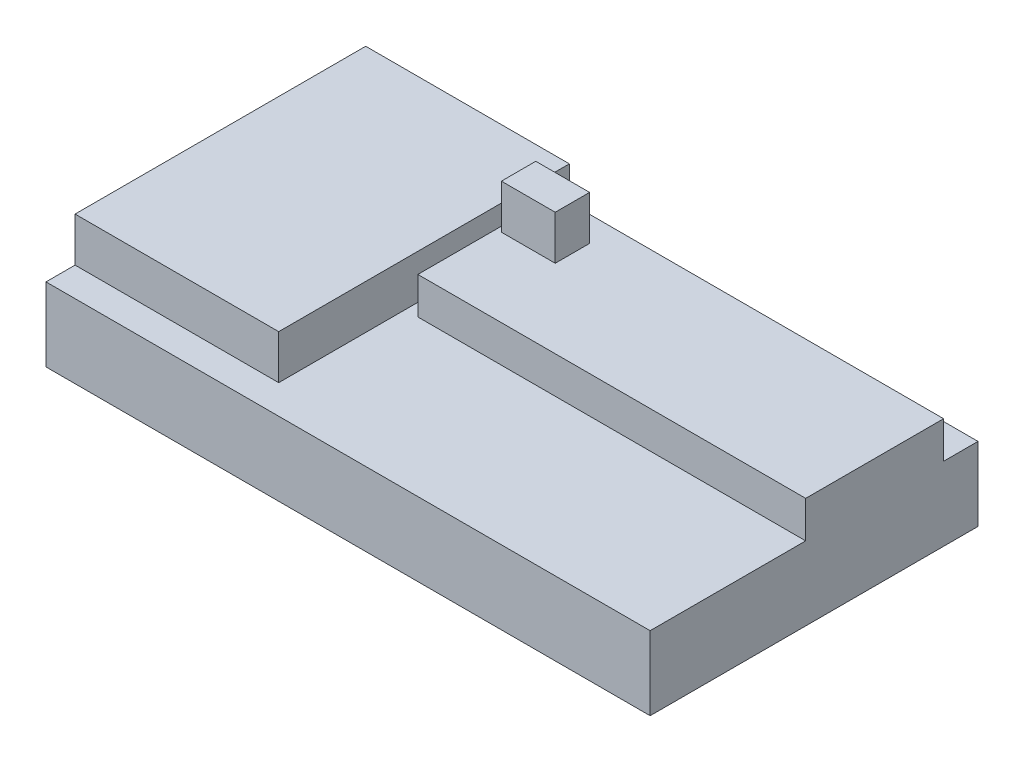
ISO-10303-21;
HEADER;
FILE_DESCRIPTION(('STEP AP214'),'2;1');
FILE_NAME('part.step','',(''),(''),'','','');
FILE_SCHEMA(('AUTOMOTIVE_DESIGN { 1 0 10303 214 1 1 1 1 }'));
ENDSEC;
DATA;
#1=APPLICATION_CONTEXT('core data for automotive mechanical design processes');
#2=APPLICATION_PROTOCOL_DEFINITION('international standard','automotive_design',2000,#1);
#3=PRODUCT_CONTEXT('',#1,'mechanical');
#4=PRODUCT('Part','Part','',(#3));
#5=PRODUCT_RELATED_PRODUCT_CATEGORY('part','',(#4));
#6=PRODUCT_DEFINITION_FORMATION('','',#4);
#7=PRODUCT_DEFINITION_CONTEXT('part definition',#1,'design');
#8=PRODUCT_DEFINITION('design','',#6,#7);
#9=PRODUCT_DEFINITION_SHAPE('','',#8);
#10=(LENGTH_UNIT() NAMED_UNIT(*) SI_UNIT(.MILLI.,.METRE.));
#11=(NAMED_UNIT(*) PLANE_ANGLE_UNIT() SI_UNIT($,.RADIAN.));
#12=(NAMED_UNIT(*) SI_UNIT($,.STERADIAN.) SOLID_ANGLE_UNIT());
#13=UNCERTAINTY_MEASURE_WITH_UNIT(LENGTH_MEASURE(1.E-05),#10,'distance_accuracy_value','');
#14=(GEOMETRIC_REPRESENTATION_CONTEXT(3) GLOBAL_UNCERTAINTY_ASSIGNED_CONTEXT((#13)) GLOBAL_UNIT_ASSIGNED_CONTEXT((#10,
#11,#12)) REPRESENTATION_CONTEXT('',''));
#15=CARTESIAN_POINT('',(0.,0.,0.));
#16=DIRECTION('',(0.,0.,1.));
#17=DIRECTION('',(1.,0.,0.));
#18=AXIS2_PLACEMENT_3D('',#15,#16,#17);
#19=CARTESIAN_POINT('',(0.,15.,0.));
#20=DIRECTION('',(0.,-1.,0.));
#21=DIRECTION('',(0.,0.,-1.));
#22=AXIS2_PLACEMENT_3D('',#19,#20,#21);
#23=PLANE('',#22);
#24=DIRECTION('',(0.,0.,-1.));
#25=VECTOR('',#24,1.);
#26=CARTESIAN_POINT('',(42.955938697318,15.,-17.9245794943016));
#27=LINE('',#26,#25);
#28=CARTESIAN_POINT('',(42.955938697318,15.,0.797509226608041));
#29=VERTEX_POINT('',#28);
#30=CARTESIAN_POINT('',(42.955938697318,15.,-17.9245794943016));
#31=VERTEX_POINT('',#30);
#32=EDGE_CURVE('E199',#29,#31,#27,.T.);
#33=ORIENTED_EDGE('',*,*,#32,.T.);
#34=DIRECTION('',(-1.,0.,0.));
#35=VECTOR('',#34,1.);
#36=CARTESIAN_POINT('',(42.955938697318,15.,-17.9245794943016));
#37=LINE('',#36,#35);
#38=CARTESIAN_POINT('',(-9.68211645351766,15.,-17.9245794943016));
#39=VERTEX_POINT('',#38);
#40=EDGE_CURVE('E202',#31,#39,#37,.T.);
#41=ORIENTED_EDGE('',*,*,#40,.T.);
#42=DIRECTION('',(0.,0.,1.));
#43=VECTOR('',#42,1.);
#44=CARTESIAN_POINT('',(-9.68211645351766,15.,-17.9245794943016));
#45=LINE('',#44,#43);
#46=CARTESIAN_POINT('',(-9.68211645351766,15.,0.797509226608041));
#47=VERTEX_POINT('',#46);
#48=EDGE_CURVE('E205',#39,#47,#45,.T.);
#49=ORIENTED_EDGE('',*,*,#48,.T.);
#50=DIRECTION('',(1.,0.,0.));
#51=VECTOR('',#50,1.);
#52=CARTESIAN_POINT('',(42.955938697318,15.,0.797509226608041));
#53=LINE('',#52,#51);
#54=EDGE_CURVE('E207',#47,#29,#53,.T.);
#55=ORIENTED_EDGE('',*,*,#54,.T.);
#56=EDGE_LOOP('',(#33,#41,#49,#55));
#57=FACE_BOUND('',#56,.T.);
#58=DIRECTION('',(0.,0.,1.));
#59=VECTOR('',#58,1.);
#60=CARTESIAN_POINT('',(-8.98032148722194,15.,-14.5036047666736));
#61=LINE('',#60,#59);
#62=CARTESIAN_POINT('',(-8.98032148722194,15.,-14.5036047666736));
#63=VERTEX_POINT('',#62);
#64=CARTESIAN_POINT('',(-8.98032148722194,15.,-9.83587875546732));
#65=VERTEX_POINT('',#64);
#66=EDGE_CURVE('E166',#63,#65,#61,.T.);
#67=ORIENTED_EDGE('',*,*,#66,.F.);
#68=DIRECTION('',(-1.,0.,0.));
#69=VECTOR('',#68,1.);
#70=CARTESIAN_POINT('',(-8.98032148722194,15.,-14.5036047666736));
#71=LINE('',#70,#69);
#72=CARTESIAN_POINT('',(-1.67256698383511,15.,-14.5036047666736));
#73=VERTEX_POINT('',#72);
#74=EDGE_CURVE('E163',#73,#63,#71,.T.);
#75=ORIENTED_EDGE('',*,*,#74,.F.);
#76=DIRECTION('',(0.,0.,-1.));
#77=VECTOR('',#76,1.);
#78=CARTESIAN_POINT('',(-1.67256698383511,15.,-14.5036047666736));
#79=LINE('',#78,#77);
#80=CARTESIAN_POINT('',(-1.67256698383511,15.,-9.83587875546732));
#81=VERTEX_POINT('',#80);
#82=EDGE_CURVE('E53',#81,#73,#79,.T.);
#83=ORIENTED_EDGE('',*,*,#82,.F.);
#84=DIRECTION('',(1.,0.,0.));
#85=VECTOR('',#84,1.);
#86=CARTESIAN_POINT('',(-8.98032148722194,15.,-9.83587875546732));
#87=LINE('',#86,#85);
#88=EDGE_CURVE('E48',#65,#81,#87,.T.);
#89=ORIENTED_EDGE('',*,*,#88,.F.);
#90=EDGE_LOOP('',(#67,#75,#83,#89));
#91=FACE_BOUND('',#90,.T.);
#92=ADVANCED_FACE('F33',(#57,#91),#23,.F.);
#93=CARTESIAN_POINT('',(0.,10.,0.));
#94=DIRECTION('',(0.,1.,0.));
#95=DIRECTION('',(0.,0.,1.));
#96=AXIS2_PLACEMENT_3D('',#93,#94,#95);
#97=PLANE('',#96);
#98=DIRECTION('',(0.,0.,-1.));
#99=VECTOR('',#98,1.);
#100=CARTESIAN_POINT('',(-11.4023417254352,10.,-21.4845338491719));
#101=LINE('',#100,#99);
#102=CARTESIAN_POINT('',(-11.4023417254352,10.,17.9656727246744));
#103=VERTEX_POINT('',#102);
#104=CARTESIAN_POINT('',(-11.4023417254352,10.,-21.4845338491719));
#105=VERTEX_POINT('',#104);
#106=EDGE_CURVE('E169',#103,#105,#101,.T.);
#107=ORIENTED_EDGE('',*,*,#106,.F.);
#108=DIRECTION('',(1.,0.,0.));
#109=VECTOR('',#108,1.);
#110=CARTESIAN_POINT('',(-39.044061302682,10.,17.9656727246744));
#111=LINE('',#110,#109);
#112=CARTESIAN_POINT('',(-39.044061302682,10.,17.9656727246744));
#113=VERTEX_POINT('',#112);
#114=EDGE_CURVE('E167',#113,#103,#111,.T.);
#115=ORIENTED_EDGE('',*,*,#114,.F.);
#116=DIRECTION('',(0.,0.,1.));
#117=VECTOR('',#116,1.);
#118=CARTESIAN_POINT('',(-39.044061302682,10.,-22.5909961685824));
#119=LINE('',#118,#117);
#120=CARTESIAN_POINT('',(-39.044061302682,10.,21.9090038314176));
#121=VERTEX_POINT('',#120);
#122=EDGE_CURVE('E233',#113,#121,#119,.T.);
#123=ORIENTED_EDGE('',*,*,#122,.T.);
#124=DIRECTION('',(1.,0.,0.));
#125=VECTOR('',#124,1.);
#126=CARTESIAN_POINT('',(-39.044061302682,10.,21.9090038314176));
#127=LINE('',#126,#125);
#128=CARTESIAN_POINT('',(42.955938697318,10.,21.9090038314176));
#129=VERTEX_POINT('',#128);
#130=EDGE_CURVE('E232',#121,#129,#127,.T.);
#131=ORIENTED_EDGE('',*,*,#130,.T.);
#132=DIRECTION('',(0.,0.,-1.));
#133=VECTOR('',#132,1.);
#134=CARTESIAN_POINT('',(42.955938697318,10.,-22.5909961685824));
#135=LINE('',#134,#133);
#136=CARTESIAN_POINT('',(42.955938697318,10.,0.79750922660804));
#137=VERTEX_POINT('',#136);
#138=EDGE_CURVE('E236',#129,#137,#135,.T.);
#139=ORIENTED_EDGE('',*,*,#138,.T.);
#140=DIRECTION('',(1.,0.,0.));
#141=VECTOR('',#140,1.);
#142=CARTESIAN_POINT('',(42.955938697318,10.,0.797509226608041));
#143=LINE('',#142,#141);
#144=CARTESIAN_POINT('',(-9.68211645351766,10.,0.797509226608041));
#145=VERTEX_POINT('',#144);
#146=EDGE_CURVE('E203',#145,#137,#143,.T.);
#147=ORIENTED_EDGE('',*,*,#146,.F.);
#148=DIRECTION('',(0.,0.,1.));
#149=VECTOR('',#148,1.);
#150=CARTESIAN_POINT('',(-9.68211645351766,10.,-17.9245794943016));
#151=LINE('',#150,#149);
#152=CARTESIAN_POINT('',(-9.68211645351766,10.,-17.9245794943016));
#153=VERTEX_POINT('',#152);
#154=EDGE_CURVE('E212',#153,#145,#151,.T.);
#155=ORIENTED_EDGE('',*,*,#154,.F.);
#156=DIRECTION('',(-1.,0.,0.));
#157=VECTOR('',#156,1.);
#158=CARTESIAN_POINT('',(42.955938697318,10.,-17.9245794943016));
#159=LINE('',#158,#157);
#160=CARTESIAN_POINT('',(42.955938697318,10.,-17.9245794943016));
#161=VERTEX_POINT('',#160);
#162=EDGE_CURVE('E198',#161,#153,#159,.T.);
#163=ORIENTED_EDGE('',*,*,#162,.F.);
#164=CARTESIAN_POINT('',(42.955938697318,10.,-22.5909961685824));
#165=VERTEX_POINT('',#164);
#166=EDGE_CURVE('E235',#161,#165,#135,.T.);
#167=ORIENTED_EDGE('',*,*,#166,.T.);
#168=DIRECTION('',(-1.,0.,0.));
#169=VECTOR('',#168,1.);
#170=CARTESIAN_POINT('',(-39.044061302682,10.,-22.5909961685824));
#171=LINE('',#170,#169);
#172=CARTESIAN_POINT('',(-39.044061302682,10.,-22.5909961685824));
#173=VERTEX_POINT('',#172);
#174=EDGE_CURVE('E238',#165,#173,#171,.T.);
#175=ORIENTED_EDGE('',*,*,#174,.T.);
#176=CARTESIAN_POINT('',(-39.044061302682,10.,-21.4845338491719));
#177=VERTEX_POINT('',#176);
#178=EDGE_CURVE('E229',#173,#177,#119,.T.);
#179=ORIENTED_EDGE('',*,*,#178,.T.);
#180=DIRECTION('',(-1.,0.,0.));
#181=VECTOR('',#180,1.);
#182=CARTESIAN_POINT('',(-39.044061302682,10.,-21.4845338491719));
#183=LINE('',#182,#181);
#184=EDGE_CURVE('E179',#105,#177,#183,.T.);
#185=ORIENTED_EDGE('',*,*,#184,.F.);
#186=EDGE_LOOP('',(#107,#115,#123,#131,#139,#147,#155,#163,#167,#175,#179,#185));
#187=FACE_BOUND('',#186,.T.);
#188=ADVANCED_FACE('F278',(#187),#97,.T.);
#189=CARTESIAN_POINT('',(-39.044061302682,10.,-22.5909961685824));
#190=DIRECTION('',(1.,0.,0.));
#191=DIRECTION('',(0.,0.,-1.));
#192=AXIS2_PLACEMENT_3D('',#189,#190,#191);
#193=PLANE('',#192);
#194=DIRECTION('',(0.,0.,1.));
#195=VECTOR('',#194,1.);
#196=CARTESIAN_POINT('',(-39.044061302682,0.,-22.5909961685824));
#197=LINE('',#196,#195);
#198=CARTESIAN_POINT('',(-39.044061302682,0.,-22.5909961685824));
#199=VERTEX_POINT('',#198);
#200=CARTESIAN_POINT('',(-39.044061302682,0.,21.9090038314176));
#201=VERTEX_POINT('',#200);
#202=EDGE_CURVE('E228',#199,#201,#197,.T.);
#203=ORIENTED_EDGE('',*,*,#202,.T.);
#204=DIRECTION('',(0.,-1.,0.));
#205=VECTOR('',#204,1.);
#206=CARTESIAN_POINT('',(-39.044061302682,10.,21.9090038314176));
#207=LINE('',#206,#205);
#208=EDGE_CURVE('E11',#121,#201,#207,.T.);
#209=ORIENTED_EDGE('',*,*,#208,.F.);
#210=ORIENTED_EDGE('',*,*,#122,.F.);
#211=DIRECTION('',(0.,-1.,0.));
#212=VECTOR('',#211,1.);
#213=CARTESIAN_POINT('',(-39.044061302682,16.,17.9656727246744));
#214=LINE('',#213,#212);
#215=CARTESIAN_POINT('',(-39.044061302682,16.,17.9656727246744));
#216=VERTEX_POINT('',#215);
#217=EDGE_CURVE('E196',#216,#113,#214,.T.);
#218=ORIENTED_EDGE('',*,*,#217,.F.);
#219=DIRECTION('',(0.,0.,1.));
#220=VECTOR('',#219,1.);
#221=CARTESIAN_POINT('',(-39.044061302682,16.,-21.4845338491719));
#222=LINE('',#221,#220);
#223=CARTESIAN_POINT('',(-39.044061302682,16.,-21.4845338491719));
#224=VERTEX_POINT('',#223);
#225=EDGE_CURVE('E175',#224,#216,#222,.T.);
#226=ORIENTED_EDGE('',*,*,#225,.F.);
#227=DIRECTION('',(0.,-1.,0.));
#228=VECTOR('',#227,1.);
#229=CARTESIAN_POINT('',(-39.044061302682,16.,-21.4845338491719));
#230=LINE('',#229,#228);
#231=EDGE_CURVE('E184',#224,#177,#230,.T.);
#232=ORIENTED_EDGE('',*,*,#231,.T.);
#233=ORIENTED_EDGE('',*,*,#178,.F.);
#234=DIRECTION('',(0.,-1.,0.));
#235=VECTOR('',#234,1.);
#236=CARTESIAN_POINT('',(-39.044061302682,10.,-22.5909961685824));
#237=LINE('',#236,#235);
#238=EDGE_CURVE('E240',#173,#199,#237,.T.);
#239=ORIENTED_EDGE('',*,*,#238,.T.);
#240=EDGE_LOOP('',(#203,#209,#210,#218,#226,#232,#233,#239));
#241=FACE_BOUND('',#240,.T.);
#242=ADVANCED_FACE('F35',(#241),#193,.F.);
#243=CARTESIAN_POINT('',(-39.044061302682,10.,21.9090038314176));
#244=DIRECTION('',(0.,0.,-1.));
#245=DIRECTION('',(-1.,0.,0.));
#246=AXIS2_PLACEMENT_3D('',#243,#244,#245);
#247=PLANE('',#246);
#248=DIRECTION('',(1.,0.,0.));
#249=VECTOR('',#248,1.);
#250=CARTESIAN_POINT('',(-39.044061302682,0.,21.9090038314176));
#251=LINE('',#250,#249);
#252=CARTESIAN_POINT('',(42.955938697318,0.,21.9090038314176));
#253=VERTEX_POINT('',#252);
#254=EDGE_CURVE('E243',#201,#253,#251,.T.);
#255=ORIENTED_EDGE('',*,*,#254,.T.);
#256=DIRECTION('',(0.,-1.,0.));
#257=VECTOR('',#256,1.);
#258=CARTESIAN_POINT('',(42.955938697318,10.,21.9090038314176));
#259=LINE('',#258,#257);
#260=EDGE_CURVE('E41',#129,#253,#259,.T.);
#261=ORIENTED_EDGE('',*,*,#260,.F.);
#262=ORIENTED_EDGE('',*,*,#130,.F.);
#263=ORIENTED_EDGE('',*,*,#208,.T.);
#264=EDGE_LOOP('',(#255,#261,#262,#263));
#265=FACE_BOUND('',#264,.T.);
#266=ADVANCED_FACE('F393',(#265),#247,.F.);
#267=CARTESIAN_POINT('',(42.955938697318,10.,-22.5909961685824));
#268=DIRECTION('',(-1.,0.,0.));
#269=DIRECTION('',(0.,0.,1.));
#270=AXIS2_PLACEMENT_3D('',#267,#268,#269);
#271=PLANE('',#270);
#272=DIRECTION('',(0.,0.,-1.));
#273=VECTOR('',#272,1.);
#274=CARTESIAN_POINT('',(42.955938697318,0.,-22.5909961685824));
#275=LINE('',#274,#273);
#276=CARTESIAN_POINT('',(42.955938697318,0.,-22.5909961685824));
#277=VERTEX_POINT('',#276);
#278=EDGE_CURVE('E245',#253,#277,#275,.T.);
#279=ORIENTED_EDGE('',*,*,#278,.T.);
#280=DIRECTION('',(0.,-1.,0.));
#281=VECTOR('',#280,1.);
#282=CARTESIAN_POINT('',(42.955938697318,10.,-22.5909961685824));
#283=LINE('',#282,#281);
#284=EDGE_CURVE('E251',#165,#277,#283,.T.);
#285=ORIENTED_EDGE('',*,*,#284,.F.);
#286=ORIENTED_EDGE('',*,*,#166,.F.);
#287=DIRECTION('',(0.,-1.,0.));
#288=VECTOR('',#287,1.);
#289=CARTESIAN_POINT('',(42.955938697318,15.,-17.9245794943016));
#290=LINE('',#289,#288);
#291=EDGE_CURVE('E225',#31,#161,#290,.T.);
#292=ORIENTED_EDGE('',*,*,#291,.F.);
#293=ORIENTED_EDGE('',*,*,#32,.F.);
#294=DIRECTION('',(0.,-1.,0.));
#295=VECTOR('',#294,1.);
#296=CARTESIAN_POINT('',(42.955938697318,15.,0.797509226608041));
#297=LINE('',#296,#295);
#298=EDGE_CURVE('E209',#29,#137,#297,.T.);
#299=ORIENTED_EDGE('',*,*,#298,.T.);
#300=ORIENTED_EDGE('',*,*,#138,.F.);
#301=ORIENTED_EDGE('',*,*,#260,.T.);
#302=EDGE_LOOP('',(#279,#285,#286,#292,#293,#299,#300,#301));
#303=FACE_BOUND('',#302,.T.);
#304=ADVANCED_FACE('F258',(#303),#271,.F.);
#305=CARTESIAN_POINT('',(-39.044061302682,10.,-22.5909961685824));
#306=DIRECTION('',(0.,0.,1.));
#307=DIRECTION('',(1.,0.,0.));
#308=AXIS2_PLACEMENT_3D('',#305,#306,#307);
#309=PLANE('',#308);
#310=DIRECTION('',(-1.,0.,0.));
#311=VECTOR('',#310,1.);
#312=CARTESIAN_POINT('',(-39.044061302682,0.,-22.5909961685824));
#313=LINE('',#312,#311);
#314=EDGE_CURVE('E247',#277,#199,#313,.T.);
#315=ORIENTED_EDGE('',*,*,#314,.T.);
#316=ORIENTED_EDGE('',*,*,#238,.F.);
#317=ORIENTED_EDGE('',*,*,#174,.F.);
#318=ORIENTED_EDGE('',*,*,#284,.T.);
#319=EDGE_LOOP('',(#315,#316,#317,#318));
#320=FACE_BOUND('',#319,.T.);
#321=ADVANCED_FACE('F268',(#320),#309,.F.);
#322=CARTESIAN_POINT('',(0.,0.,0.));
#323=DIRECTION('',(0.,1.,0.));
#324=DIRECTION('',(0.,0.,1.));
#325=AXIS2_PLACEMENT_3D('',#322,#323,#324);
#326=PLANE('',#325);
#327=ORIENTED_EDGE('',*,*,#202,.F.);
#328=ORIENTED_EDGE('',*,*,#314,.F.);
#329=ORIENTED_EDGE('',*,*,#278,.F.);
#330=ORIENTED_EDGE('',*,*,#254,.F.);
#331=EDGE_LOOP('',(#327,#328,#329,#330));
#332=FACE_BOUND('',#331,.T.);
#333=ADVANCED_FACE('F265',(#332),#326,.F.);
#334=CARTESIAN_POINT('',(42.955938697318,15.,-17.9245794943016));
#335=DIRECTION('',(0.,0.,1.));
#336=DIRECTION('',(1.,0.,0.));
#337=AXIS2_PLACEMENT_3D('',#334,#335,#336);
#338=PLANE('',#337);
#339=ORIENTED_EDGE('',*,*,#162,.T.);
#340=DIRECTION('',(0.,-1.,0.));
#341=VECTOR('',#340,1.);
#342=CARTESIAN_POINT('',(-9.68211645351766,15.,-17.9245794943016));
#343=LINE('',#342,#341);
#344=EDGE_CURVE('E222',#39,#153,#343,.T.);
#345=ORIENTED_EDGE('',*,*,#344,.F.);
#346=ORIENTED_EDGE('',*,*,#40,.F.);
#347=ORIENTED_EDGE('',*,*,#291,.T.);
#348=EDGE_LOOP('',(#339,#345,#346,#347));
#349=FACE_BOUND('',#348,.T.);
#350=ADVANCED_FACE('F283',(#349),#338,.F.);
#351=CARTESIAN_POINT('',(-9.68211645351766,15.,-17.9245794943016));
#352=DIRECTION('',(1.,0.,0.));
#353=DIRECTION('',(0.,0.,-1.));
#354=AXIS2_PLACEMENT_3D('',#351,#352,#353);
#355=PLANE('',#354);
#356=ORIENTED_EDGE('',*,*,#154,.T.);
#357=DIRECTION('',(0.,-1.,0.));
#358=VECTOR('',#357,1.);
#359=CARTESIAN_POINT('',(-9.68211645351766,15.,0.797509226608041));
#360=LINE('',#359,#358);
#361=EDGE_CURVE('E219',#47,#145,#360,.T.);
#362=ORIENTED_EDGE('',*,*,#361,.F.);
#363=ORIENTED_EDGE('',*,*,#48,.F.);
#364=ORIENTED_EDGE('',*,*,#344,.T.);
#365=EDGE_LOOP('',(#356,#362,#363,#364));
#366=FACE_BOUND('',#365,.T.);
#367=ADVANCED_FACE('F293',(#366),#355,.F.);
#368=CARTESIAN_POINT('',(42.955938697318,15.,0.797509226608041));
#369=DIRECTION('',(0.,0.,-1.));
#370=DIRECTION('',(-1.,0.,0.));
#371=AXIS2_PLACEMENT_3D('',#368,#369,#370);
#372=PLANE('',#371);
#373=ORIENTED_EDGE('',*,*,#146,.T.);
#374=ORIENTED_EDGE('',*,*,#298,.F.);
#375=ORIENTED_EDGE('',*,*,#54,.F.);
#376=ORIENTED_EDGE('',*,*,#361,.T.);
#377=EDGE_LOOP('',(#373,#374,#375,#376));
#378=FACE_BOUND('',#377,.T.);
#379=ADVANCED_FACE('F290',(#378),#372,.F.);
#380=CARTESIAN_POINT('',(-39.044061302682,16.,17.9656727246744));
#381=DIRECTION('',(0.,0.,-1.));
#382=DIRECTION('',(-1.,0.,0.));
#383=AXIS2_PLACEMENT_3D('',#380,#381,#382);
#384=PLANE('',#383);
#385=ORIENTED_EDGE('',*,*,#114,.T.);
#386=DIRECTION('',(0.,-1.,0.));
#387=VECTOR('',#386,1.);
#388=CARTESIAN_POINT('',(-11.4023417254352,16.,17.9656727246744));
#389=LINE('',#388,#387);
#390=CARTESIAN_POINT('',(-11.4023417254352,16.,17.9656727246744));
#391=VERTEX_POINT('',#390);
#392=EDGE_CURVE('E193',#391,#103,#389,.T.);
#393=ORIENTED_EDGE('',*,*,#392,.F.);
#394=DIRECTION('',(1.,0.,0.));
#395=VECTOR('',#394,1.);
#396=CARTESIAN_POINT('',(-39.044061302682,16.,17.9656727246744));
#397=LINE('',#396,#395);
#398=EDGE_CURVE('E178',#216,#391,#397,.T.);
#399=ORIENTED_EDGE('',*,*,#398,.F.);
#400=ORIENTED_EDGE('',*,*,#217,.T.);
#401=EDGE_LOOP('',(#385,#393,#399,#400));
#402=FACE_BOUND('',#401,.T.);
#403=ADVANCED_FACE('F300',(#402),#384,.F.);
#404=CARTESIAN_POINT('',(-11.4023417254352,16.,-21.4845338491719));
#405=DIRECTION('',(-1.,0.,0.));
#406=DIRECTION('',(0.,0.,1.));
#407=AXIS2_PLACEMENT_3D('',#404,#405,#406);
#408=PLANE('',#407);
#409=ORIENTED_EDGE('',*,*,#106,.T.);
#410=DIRECTION('',(0.,-1.,0.));
#411=VECTOR('',#410,1.);
#412=CARTESIAN_POINT('',(-11.4023417254352,16.,-21.4845338491719));
#413=LINE('',#412,#411);
#414=CARTESIAN_POINT('',(-11.4023417254352,16.,-21.4845338491719));
#415=VERTEX_POINT('',#414);
#416=EDGE_CURVE('E191',#415,#105,#413,.T.);
#417=ORIENTED_EDGE('',*,*,#416,.F.);
#418=DIRECTION('',(0.,0.,-1.));
#419=VECTOR('',#418,1.);
#420=CARTESIAN_POINT('',(-11.4023417254352,16.,-21.4845338491719));
#421=LINE('',#420,#419);
#422=EDGE_CURVE('E181',#391,#415,#421,.T.);
#423=ORIENTED_EDGE('',*,*,#422,.F.);
#424=ORIENTED_EDGE('',*,*,#392,.T.);
#425=EDGE_LOOP('',(#409,#417,#423,#424));
#426=FACE_BOUND('',#425,.T.);
#427=ADVANCED_FACE('F312',(#426),#408,.F.);
#428=CARTESIAN_POINT('',(-39.044061302682,16.,-21.4845338491719));
#429=DIRECTION('',(0.,0.,1.));
#430=DIRECTION('',(1.,0.,0.));
#431=AXIS2_PLACEMENT_3D('',#428,#429,#430);
#432=PLANE('',#431);
#433=ORIENTED_EDGE('',*,*,#184,.T.);
#434=ORIENTED_EDGE('',*,*,#231,.F.);
#435=DIRECTION('',(-1.,0.,0.));
#436=VECTOR('',#435,1.);
#437=CARTESIAN_POINT('',(-39.044061302682,16.,-21.4845338491719));
#438=LINE('',#437,#436);
#439=EDGE_CURVE('E183',#415,#224,#438,.T.);
#440=ORIENTED_EDGE('',*,*,#439,.F.);
#441=ORIENTED_EDGE('',*,*,#416,.T.);
#442=EDGE_LOOP('',(#433,#434,#440,#441));
#443=FACE_BOUND('',#442,.T.);
#444=ADVANCED_FACE('F316',(#443),#432,.F.);
#445=CARTESIAN_POINT('',(0.,16.,0.));
#446=DIRECTION('',(0.,1.,0.));
#447=DIRECTION('',(0.,0.,1.));
#448=AXIS2_PLACEMENT_3D('',#445,#446,#447);
#449=PLANE('',#448);
#450=ORIENTED_EDGE('',*,*,#225,.T.);
#451=ORIENTED_EDGE('',*,*,#398,.T.);
#452=ORIENTED_EDGE('',*,*,#422,.T.);
#453=ORIENTED_EDGE('',*,*,#439,.T.);
#454=EDGE_LOOP('',(#450,#451,#452,#453));
#455=FACE_BOUND('',#454,.T.);
#456=ADVANCED_FACE('F320',(#455),#449,.T.);
#457=CARTESIAN_POINT('',(-8.98032148722194,21.,-14.5036047666736));
#458=DIRECTION('',(1.,0.,0.));
#459=DIRECTION('',(0.,0.,-1.));
#460=AXIS2_PLACEMENT_3D('',#457,#458,#459);
#461=PLANE('',#460);
#462=ORIENTED_EDGE('',*,*,#66,.T.);
#463=DIRECTION('',(0.,-1.,0.));
#464=VECTOR('',#463,1.);
#465=CARTESIAN_POINT('',(-8.98032148722194,21.,-9.83587875546732));
#466=LINE('',#465,#464);
#467=CARTESIAN_POINT('',(-8.98032148722194,21.,-9.83587875546732));
#468=VERTEX_POINT('',#467);
#469=EDGE_CURVE('E147',#468,#65,#466,.T.);
#470=ORIENTED_EDGE('',*,*,#469,.F.);
#471=DIRECTION('',(0.,0.,1.));
#472=VECTOR('',#471,1.);
#473=CARTESIAN_POINT('',(-8.98032148722194,21.,-14.5036047666736));
#474=LINE('',#473,#472);
#475=CARTESIAN_POINT('',(-8.98032148722194,21.,-14.5036047666736));
#476=VERTEX_POINT('',#475);
#477=EDGE_CURVE('E154',#476,#468,#474,.T.);
#478=ORIENTED_EDGE('',*,*,#477,.F.);
#479=DIRECTION('',(0.,-1.,0.));
#480=VECTOR('',#479,1.);
#481=CARTESIAN_POINT('',(-8.98032148722194,21.,-14.5036047666736));
#482=LINE('',#481,#480);
#483=EDGE_CURVE('E472',#476,#63,#482,.T.);
#484=ORIENTED_EDGE('',*,*,#483,.T.);
#485=EDGE_LOOP('',(#462,#470,#478,#484));
#486=FACE_BOUND('',#485,.T.);
#487=ADVANCED_FACE('F165',(#486),#461,.F.);
#488=CARTESIAN_POINT('',(-8.98032148722194,21.,-9.83587875546732));
#489=DIRECTION('',(0.,0.,-1.));
#490=DIRECTION('',(-1.,0.,0.));
#491=AXIS2_PLACEMENT_3D('',#488,#489,#490);
#492=PLANE('',#491);
#493=ORIENTED_EDGE('',*,*,#88,.T.);
#494=DIRECTION('',(0.,-1.,0.));
#495=VECTOR('',#494,1.);
#496=CARTESIAN_POINT('',(-1.67256698383511,21.,-9.83587875546732));
#497=LINE('',#496,#495);
#498=CARTESIAN_POINT('',(-1.67256698383511,21.,-9.83587875546732));
#499=VERTEX_POINT('',#498);
#500=EDGE_CURVE('E150',#499,#81,#497,.T.);
#501=ORIENTED_EDGE('',*,*,#500,.F.);
#502=DIRECTION('',(1.,0.,0.));
#503=VECTOR('',#502,1.);
#504=CARTESIAN_POINT('',(-8.98032148722194,21.,-9.83587875546732));
#505=LINE('',#504,#503);
#506=EDGE_CURVE('E143',#468,#499,#505,.T.);
#507=ORIENTED_EDGE('',*,*,#506,.F.);
#508=ORIENTED_EDGE('',*,*,#469,.T.);
#509=EDGE_LOOP('',(#493,#501,#507,#508));
#510=FACE_BOUND('',#509,.T.);
#511=ADVANCED_FACE('F145',(#510),#492,.F.);
#512=CARTESIAN_POINT('',(-1.67256698383511,21.,-14.5036047666736));
#513=DIRECTION('',(-1.,0.,0.));
#514=DIRECTION('',(0.,0.,1.));
#515=AXIS2_PLACEMENT_3D('',#512,#513,#514);
#516=PLANE('',#515);
#517=ORIENTED_EDGE('',*,*,#82,.T.);
#518=DIRECTION('',(0.,-1.,0.));
#519=VECTOR('',#518,1.);
#520=CARTESIAN_POINT('',(-1.67256698383511,21.,-14.5036047666736));
#521=LINE('',#520,#519);
#522=CARTESIAN_POINT('',(-1.67256698383511,21.,-14.5036047666736));
#523=VERTEX_POINT('',#522);
#524=EDGE_CURVE('E171',#523,#73,#521,.T.);
#525=ORIENTED_EDGE('',*,*,#524,.F.);
#526=DIRECTION('',(0.,0.,-1.));
#527=VECTOR('',#526,1.);
#528=CARTESIAN_POINT('',(-1.67256698383511,21.,-14.5036047666736));
#529=LINE('',#528,#527);
#530=EDGE_CURVE('E153',#499,#523,#529,.T.);
#531=ORIENTED_EDGE('',*,*,#530,.F.);
#532=ORIENTED_EDGE('',*,*,#500,.T.);
#533=EDGE_LOOP('',(#517,#525,#531,#532));
#534=FACE_BOUND('',#533,.T.);
#535=ADVANCED_FACE('F329',(#534),#516,.F.);
#536=CARTESIAN_POINT('',(-8.98032148722194,21.,-14.5036047666736));
#537=DIRECTION('',(0.,0.,1.));
#538=DIRECTION('',(1.,0.,0.));
#539=AXIS2_PLACEMENT_3D('',#536,#537,#538);
#540=PLANE('',#539);
#541=ORIENTED_EDGE('',*,*,#74,.T.);
#542=ORIENTED_EDGE('',*,*,#483,.F.);
#543=DIRECTION('',(-1.,0.,0.));
#544=VECTOR('',#543,1.);
#545=CARTESIAN_POINT('',(-8.98032148722194,21.,-14.5036047666736));
#546=LINE('',#545,#544);
#547=EDGE_CURVE('E159',#523,#476,#546,.T.);
#548=ORIENTED_EDGE('',*,*,#547,.F.);
#549=ORIENTED_EDGE('',*,*,#524,.T.);
#550=EDGE_LOOP('',(#541,#542,#548,#549));
#551=FACE_BOUND('',#550,.T.);
#552=ADVANCED_FACE('F332',(#551),#540,.F.);
#553=CARTESIAN_POINT('',(0.,21.,0.));
#554=DIRECTION('',(0.,1.,0.));
#555=DIRECTION('',(0.,0.,1.));
#556=AXIS2_PLACEMENT_3D('',#553,#554,#555);
#557=PLANE('',#556);
#558=ORIENTED_EDGE('',*,*,#477,.T.);
#559=ORIENTED_EDGE('',*,*,#506,.T.);
#560=ORIENTED_EDGE('',*,*,#530,.T.);
#561=ORIENTED_EDGE('',*,*,#547,.T.);
#562=EDGE_LOOP('',(#558,#559,#560,#561));
#563=FACE_BOUND('',#562,.T.);
#564=ADVANCED_FACE('F157',(#563),#557,.T.);
#565=CLOSED_SHELL('',(#92,#188,#242,#266,#304,#321,#333,#350,#367,#379,#403,#427,#444,#456,#487,
#511,#535,#552,#564));
#566=MANIFOLD_SOLID_BREP('B2',#565);
#567=ADVANCED_BREP_SHAPE_REPRESENTATION('',(#18,#566),#14);
#568=SHAPE_DEFINITION_REPRESENTATION(#9,#567);
ENDSEC;
END-ISO-10303-21;
